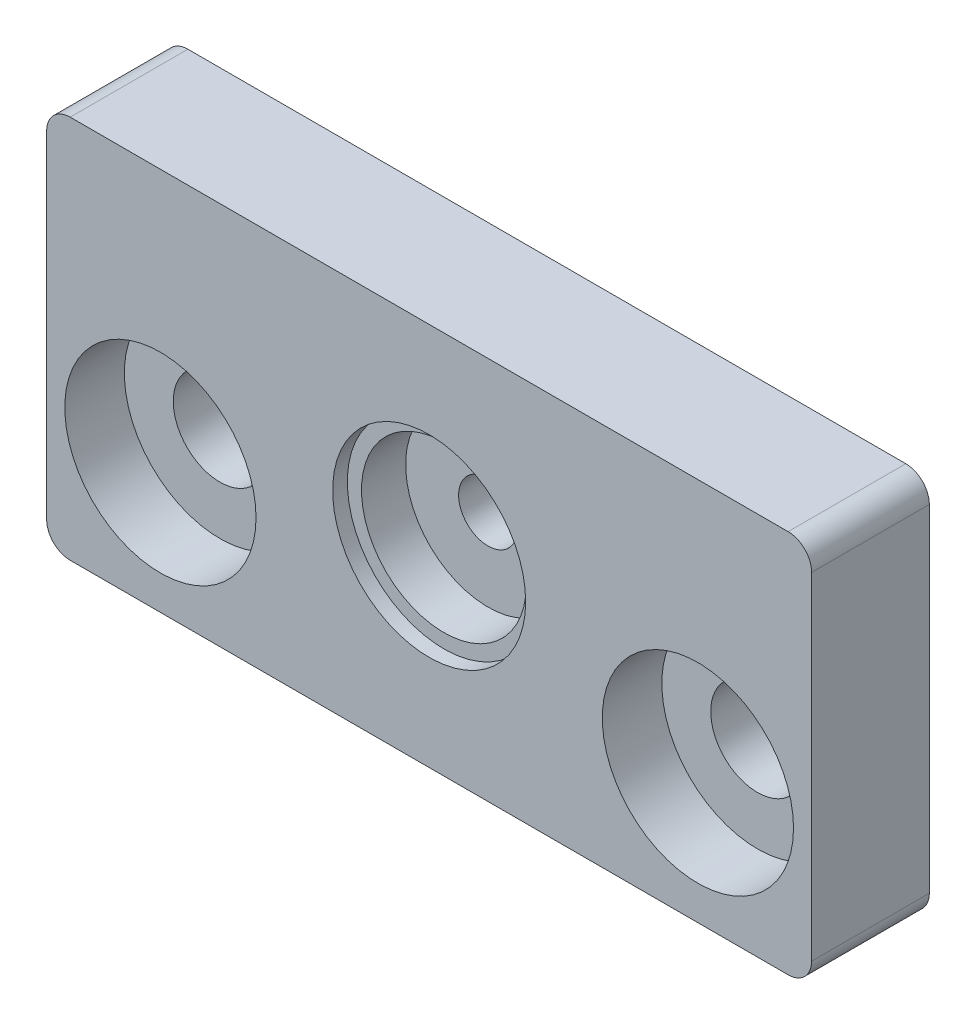
ISO-10303-21;
HEADER;
FILE_DESCRIPTION(('STEP AP214'),'2;1');
FILE_NAME('part.step','',(''),(''),'','','');
FILE_SCHEMA(('AUTOMOTIVE_DESIGN { 1 0 10303 214 1 1 1 1 }'));
ENDSEC;
DATA;
#1=APPLICATION_CONTEXT('core data for automotive mechanical design processes');
#2=APPLICATION_PROTOCOL_DEFINITION('international standard','automotive_design',2000,#1);
#3=PRODUCT_CONTEXT('',#1,'mechanical');
#4=PRODUCT('Part','Part','',(#3));
#5=PRODUCT_RELATED_PRODUCT_CATEGORY('part','',(#4));
#6=PRODUCT_DEFINITION_FORMATION('','',#4);
#7=PRODUCT_DEFINITION_CONTEXT('part definition',#1,'design');
#8=PRODUCT_DEFINITION('design','',#6,#7);
#9=PRODUCT_DEFINITION_SHAPE('','',#8);
#10=(LENGTH_UNIT() NAMED_UNIT(*) SI_UNIT(.MILLI.,.METRE.));
#11=(NAMED_UNIT(*) PLANE_ANGLE_UNIT() SI_UNIT($,.RADIAN.));
#12=(NAMED_UNIT(*) SI_UNIT($,.STERADIAN.) SOLID_ANGLE_UNIT());
#13=UNCERTAINTY_MEASURE_WITH_UNIT(LENGTH_MEASURE(1.E-05),#10,'distance_accuracy_value','');
#14=(GEOMETRIC_REPRESENTATION_CONTEXT(3) GLOBAL_UNCERTAINTY_ASSIGNED_CONTEXT((#13)) GLOBAL_UNIT_ASSIGNED_CONTEXT((#10,
#11,#12)) REPRESENTATION_CONTEXT('',''));
#15=CARTESIAN_POINT('',(0.,0.,0.));
#16=DIRECTION('',(0.,0.,1.));
#17=DIRECTION('',(1.,0.,0.));
#18=AXIS2_PLACEMENT_3D('',#15,#16,#17);
#19=CARTESIAN_POINT('',(0.,0.,6.35));
#20=DIRECTION('',(0.,0.,1.));
#21=DIRECTION('',(1.,0.,0.));
#22=AXIS2_PLACEMENT_3D('',#19,#20,#21);
#23=CYLINDRICAL_SURFACE('',#22,8.89);
#24=CARTESIAN_POINT('',(0.,0.,6.35));
#25=DIRECTION('',(0.,0.,1.));
#26=DIRECTION('',(1.,0.,0.));
#27=AXIS2_PLACEMENT_3D('',#24,#25,#26);
#28=CIRCLE('',#27,8.89);
#29=CARTESIAN_POINT('',(8.89,0.,6.35));
#30=VERTEX_POINT('',#29);
#31=EDGE_CURVE('E145',#30,#30,#28,.T.);
#32=ORIENTED_EDGE('',*,*,#31,.F.);
#33=EDGE_LOOP('',(#32));
#34=FACE_BOUND('',#33,.T.);
#35=CARTESIAN_POINT('',(0.,0.,11.1125));
#36=DIRECTION('',(0.,0.,1.));
#37=DIRECTION('',(1.,0.,0.));
#38=AXIS2_PLACEMENT_3D('',#35,#36,#37);
#39=CIRCLE('',#38,8.89);
#40=CARTESIAN_POINT('',(8.89,0.,11.1125));
#41=VERTEX_POINT('',#40);
#42=EDGE_CURVE('E146',#41,#41,#39,.F.);
#43=ORIENTED_EDGE('',*,*,#42,.F.);
#44=EDGE_LOOP('',(#43));
#45=FACE_BOUND('',#44,.T.);
#46=ADVANCED_FACE('F35',(#34,#45),#23,.F.);
#47=CARTESIAN_POINT('',(0.,0.,0.));
#48=DIRECTION('',(0.,0.,1.));
#49=DIRECTION('',(1.,0.,0.));
#50=AXIS2_PLACEMENT_3D('',#47,#48,#49);
#51=CYLINDRICAL_SURFACE('',#50,3.175);
#52=CARTESIAN_POINT('',(0.,0.,0.));
#53=DIRECTION('',(0.,0.,1.));
#54=DIRECTION('',(1.,0.,0.));
#55=AXIS2_PLACEMENT_3D('',#52,#53,#54);
#56=CIRCLE('',#55,3.175);
#57=CARTESIAN_POINT('',(3.175,0.,0.));
#58=VERTEX_POINT('',#57);
#59=EDGE_CURVE('E128',#58,#58,#56,.T.);
#60=ORIENTED_EDGE('',*,*,#59,.F.);
#61=EDGE_LOOP('',(#60));
#62=FACE_BOUND('',#61,.T.);
#63=CARTESIAN_POINT('',(0.,0.,6.35));
#64=DIRECTION('',(0.,0.,1.));
#65=DIRECTION('',(1.,0.,0.));
#66=AXIS2_PLACEMENT_3D('',#63,#64,#65);
#67=CIRCLE('',#66,3.175);
#68=CARTESIAN_POINT('',(3.175,0.,6.35));
#69=VERTEX_POINT('',#68);
#70=EDGE_CURVE('E134',#69,#69,#67,.F.);
#71=ORIENTED_EDGE('',*,*,#70,.F.);
#72=EDGE_LOOP('',(#71));
#73=FACE_BOUND('',#72,.T.);
#74=ADVANCED_FACE('F244',(#62,#73),#51,.F.);
#75=CARTESIAN_POINT('',(41.275,-20.70735,12.7));
#76=DIRECTION('',(-1.,0.,0.));
#77=DIRECTION('',(0.,0.,1.));
#78=AXIS2_PLACEMENT_3D('',#75,#76,#77);
#79=PLANE('',#78);
#80=DIRECTION('',(0.,1.,0.));
#81=VECTOR('',#80,1.);
#82=CARTESIAN_POINT('',(41.275,-20.70735,12.7));
#83=LINE('',#82,#81);
#84=CARTESIAN_POINT('',(41.275,-18.16735,12.7));
#85=VERTEX_POINT('',#84);
#86=CARTESIAN_POINT('',(41.275,18.16735,12.7));
#87=VERTEX_POINT('',#86);
#88=EDGE_CURVE('E121',#85,#87,#83,.T.);
#89=ORIENTED_EDGE('',*,*,#88,.F.);
#90=DIRECTION('',(0.,0.,-1.));
#91=VECTOR('',#90,1.);
#92=CARTESIAN_POINT('',(41.275,-18.16735,12.7));
#93=LINE('',#92,#91);
#94=CARTESIAN_POINT('',(41.275,-18.16735,0.));
#95=VERTEX_POINT('',#94);
#96=EDGE_CURVE('E105',#85,#95,#93,.T.);
#97=ORIENTED_EDGE('',*,*,#96,.T.);
#98=DIRECTION('',(0.,1.,0.));
#99=VECTOR('',#98,1.);
#100=CARTESIAN_POINT('',(41.275,-20.70735,0.));
#101=LINE('',#100,#99);
#102=CARTESIAN_POINT('',(41.275,18.16735,0.));
#103=VERTEX_POINT('',#102);
#104=EDGE_CURVE('E118',#95,#103,#101,.T.);
#105=ORIENTED_EDGE('',*,*,#104,.T.);
#106=DIRECTION('',(0.,0.,-1.));
#107=VECTOR('',#106,1.);
#108=CARTESIAN_POINT('',(41.275,18.16735,12.7));
#109=LINE('',#108,#107);
#110=EDGE_CURVE('E123',#103,#87,#109,.F.);
#111=ORIENTED_EDGE('',*,*,#110,.T.);
#112=EDGE_LOOP('',(#89,#97,#105,#111));
#113=FACE_BOUND('',#112,.T.);
#114=ADVANCED_FACE('F117',(#113),#79,.F.);
#115=CARTESIAN_POINT('',(-41.275,20.70735,12.7));
#116=DIRECTION('',(0.,-1.,0.));
#117=DIRECTION('',(0.,0.,-1.));
#118=AXIS2_PLACEMENT_3D('',#115,#116,#117);
#119=PLANE('',#118);
#120=DIRECTION('',(-1.,0.,0.));
#121=VECTOR('',#120,1.);
#122=CARTESIAN_POINT('',(-41.275,20.70735,0.));
#123=LINE('',#122,#121);
#124=CARTESIAN_POINT('',(38.735,20.70735,0.));
#125=VERTEX_POINT('',#124);
#126=CARTESIAN_POINT('',(-38.735,20.70735,0.));
#127=VERTEX_POINT('',#126);
#128=EDGE_CURVE('E127',#125,#127,#123,.T.);
#129=ORIENTED_EDGE('',*,*,#128,.T.);
#130=DIRECTION('',(0.,0.,-1.));
#131=VECTOR('',#130,1.);
#132=CARTESIAN_POINT('',(-38.735,20.70735,12.7));
#133=LINE('',#132,#131);
#134=CARTESIAN_POINT('',(-38.735,20.70735,12.7));
#135=VERTEX_POINT('',#134);
#136=EDGE_CURVE('E11',#127,#135,#133,.F.);
#137=ORIENTED_EDGE('',*,*,#136,.T.);
#138=DIRECTION('',(-1.,0.,0.));
#139=VECTOR('',#138,1.);
#140=CARTESIAN_POINT('',(-41.275,20.70735,12.7));
#141=LINE('',#140,#139);
#142=CARTESIAN_POINT('',(38.735,20.70735,12.7));
#143=VERTEX_POINT('',#142);
#144=EDGE_CURVE('E174',#143,#135,#141,.T.);
#145=ORIENTED_EDGE('',*,*,#144,.F.);
#146=DIRECTION('',(0.,0.,-1.));
#147=VECTOR('',#146,1.);
#148=CARTESIAN_POINT('',(38.735,20.70735,12.7));
#149=LINE('',#148,#147);
#150=EDGE_CURVE('E43',#143,#125,#149,.T.);
#151=ORIENTED_EDGE('',*,*,#150,.T.);
#152=EDGE_LOOP('',(#129,#137,#145,#151));
#153=FACE_BOUND('',#152,.T.);
#154=ADVANCED_FACE('F172',(#153),#119,.F.);
#155=CARTESIAN_POINT('',(-41.275,-20.70735,12.7));
#156=DIRECTION('',(1.,0.,0.));
#157=DIRECTION('',(0.,0.,-1.));
#158=AXIS2_PLACEMENT_3D('',#155,#156,#157);
#159=PLANE('',#158);
#160=DIRECTION('',(0.,-1.,0.));
#161=VECTOR('',#160,1.);
#162=CARTESIAN_POINT('',(-41.275,-20.70735,0.));
#163=LINE('',#162,#161);
#164=CARTESIAN_POINT('',(-41.275,18.16735,0.));
#165=VERTEX_POINT('',#164);
#166=CARTESIAN_POINT('',(-41.275,-18.16735,0.));
#167=VERTEX_POINT('',#166);
#168=EDGE_CURVE('E131',#165,#167,#163,.T.);
#169=ORIENTED_EDGE('',*,*,#168,.T.);
#170=DIRECTION('',(0.,0.,-1.));
#171=VECTOR('',#170,1.);
#172=CARTESIAN_POINT('',(-41.275,-18.16735,12.7));
#173=LINE('',#172,#171);
#174=CARTESIAN_POINT('',(-41.275,-18.16735,12.7));
#175=VERTEX_POINT('',#174);
#176=EDGE_CURVE('E50',#167,#175,#173,.F.);
#177=ORIENTED_EDGE('',*,*,#176,.T.);
#178=DIRECTION('',(0.,-1.,0.));
#179=VECTOR('',#178,1.);
#180=CARTESIAN_POINT('',(-41.275,-20.70735,12.7));
#181=LINE('',#180,#179);
#182=CARTESIAN_POINT('',(-41.275,18.16735,12.7));
#183=VERTEX_POINT('',#182);
#184=EDGE_CURVE('E182',#183,#175,#181,.T.);
#185=ORIENTED_EDGE('',*,*,#184,.F.);
#186=DIRECTION('',(0.,0.,-1.));
#187=VECTOR('',#186,1.);
#188=CARTESIAN_POINT('',(-41.275,18.16735,12.7));
#189=LINE('',#188,#187);
#190=EDGE_CURVE('E165',#183,#165,#189,.T.);
#191=ORIENTED_EDGE('',*,*,#190,.T.);
#192=EDGE_LOOP('',(#169,#177,#185,#191));
#193=FACE_BOUND('',#192,.T.);
#194=ADVANCED_FACE('F181',(#193),#159,.F.);
#195=CARTESIAN_POINT('',(-41.275,-20.70735,12.7));
#196=DIRECTION('',(0.,1.,0.));
#197=DIRECTION('',(0.,0.,1.));
#198=AXIS2_PLACEMENT_3D('',#195,#196,#197);
#199=PLANE('',#198);
#200=DIRECTION('',(1.,0.,0.));
#201=VECTOR('',#200,1.);
#202=CARTESIAN_POINT('',(-41.275,-20.70735,0.));
#203=LINE('',#202,#201);
#204=CARTESIAN_POINT('',(-38.735,-20.70735,0.));
#205=VERTEX_POINT('',#204);
#206=CARTESIAN_POINT('',(38.735,-20.70735,0.));
#207=VERTEX_POINT('',#206);
#208=EDGE_CURVE('E141',#205,#207,#203,.T.);
#209=ORIENTED_EDGE('',*,*,#208,.T.);
#210=DIRECTION('',(0.,0.,-1.));
#211=VECTOR('',#210,1.);
#212=CARTESIAN_POINT('',(38.735,-20.70735,12.7));
#213=LINE('',#212,#211);
#214=CARTESIAN_POINT('',(38.735,-20.70735,12.7));
#215=VERTEX_POINT('',#214);
#216=EDGE_CURVE('E106',#207,#215,#213,.F.);
#217=ORIENTED_EDGE('',*,*,#216,.T.);
#218=DIRECTION('',(1.,0.,0.));
#219=VECTOR('',#218,1.);
#220=CARTESIAN_POINT('',(-41.275,-20.70735,12.7));
#221=LINE('',#220,#219);
#222=CARTESIAN_POINT('',(-38.735,-20.70735,12.7));
#223=VERTEX_POINT('',#222);
#224=EDGE_CURVE('E137',#223,#215,#221,.T.);
#225=ORIENTED_EDGE('',*,*,#224,.F.);
#226=DIRECTION('',(0.,0.,-1.));
#227=VECTOR('',#226,1.);
#228=CARTESIAN_POINT('',(-38.735,-20.70735,12.7));
#229=LINE('',#228,#227);
#230=EDGE_CURVE('E111',#223,#205,#229,.T.);
#231=ORIENTED_EDGE('',*,*,#230,.T.);
#232=EDGE_LOOP('',(#209,#217,#225,#231));
#233=FACE_BOUND('',#232,.T.);
#234=ADVANCED_FACE('F225',(#233),#199,.F.);
#235=CARTESIAN_POINT('',(0.,0.,12.7));
#236=DIRECTION('',(0.,0.,-1.));
#237=DIRECTION('',(-1.,0.,0.));
#238=AXIS2_PLACEMENT_3D('',#235,#236,#237);
#239=PLANE('',#238);
#240=CARTESIAN_POINT('',(29.,-6.708000046,12.7));
#241=DIRECTION('',(0.,0.,1.));
#242=DIRECTION('',(1.,0.,0.));
#243=AXIS2_PLACEMENT_3D('',#240,#241,#242);
#244=CIRCLE('',#243,10.31875);
#245=CARTESIAN_POINT('',(39.31875,-6.708000046,12.7));
#246=VERTEX_POINT('',#245);
#247=EDGE_CURVE('E216',#246,#246,#244,.T.);
#248=ORIENTED_EDGE('',*,*,#247,.F.);
#249=EDGE_LOOP('',(#248));
#250=FACE_BOUND('',#249,.T.);
#251=CARTESIAN_POINT('',(-29.,-6.708000046,12.7));
#252=DIRECTION('',(0.,0.,1.));
#253=DIRECTION('',(1.,0.,0.));
#254=AXIS2_PLACEMENT_3D('',#251,#252,#253);
#255=CIRCLE('',#254,10.31875);
#256=CARTESIAN_POINT('',(-18.68125,-6.708000046,12.7));
#257=VERTEX_POINT('',#256);
#258=EDGE_CURVE('E204',#257,#257,#255,.T.);
#259=ORIENTED_EDGE('',*,*,#258,.F.);
#260=EDGE_LOOP('',(#259));
#261=FACE_BOUND('',#260,.T.);
#262=CARTESIAN_POINT('',(0.,0.,12.7));
#263=DIRECTION('',(0.,0.,1.));
#264=DIRECTION('',(1.,0.,0.));
#265=AXIS2_PLACEMENT_3D('',#262,#263,#264);
#266=CIRCLE('',#265,10.414);
#267=CARTESIAN_POINT('',(10.414,0.,12.7));
#268=VERTEX_POINT('',#267);
#269=EDGE_CURVE('E190',#268,#268,#266,.T.);
#270=ORIENTED_EDGE('',*,*,#269,.F.);
#271=EDGE_LOOP('',(#270));
#272=FACE_BOUND('',#271,.T.);
#273=ORIENTED_EDGE('',*,*,#224,.T.);
#274=CARTESIAN_POINT('',(38.735,-18.16735,12.7));
#275=DIRECTION('',(0.,0.,-1.));
#276=DIRECTION('',(-1.,0.,0.));
#277=AXIS2_PLACEMENT_3D('',#274,#275,#276);
#278=CIRCLE('',#277,2.54);
#279=EDGE_CURVE('E163',#215,#85,#278,.F.);
#280=ORIENTED_EDGE('',*,*,#279,.T.);
#281=ORIENTED_EDGE('',*,*,#88,.T.);
#282=CARTESIAN_POINT('',(38.735,18.16735,12.7));
#283=DIRECTION('',(0.,0.,-1.));
#284=DIRECTION('',(-1.,0.,0.));
#285=AXIS2_PLACEMENT_3D('',#282,#283,#284);
#286=CIRCLE('',#285,2.54);
#287=EDGE_CURVE('E158',#87,#143,#286,.F.);
#288=ORIENTED_EDGE('',*,*,#287,.T.);
#289=ORIENTED_EDGE('',*,*,#144,.T.);
#290=CARTESIAN_POINT('',(-38.735,18.16735,12.7));
#291=DIRECTION('',(0.,0.,-1.));
#292=DIRECTION('',(-1.,0.,0.));
#293=AXIS2_PLACEMENT_3D('',#290,#291,#292);
#294=CIRCLE('',#293,2.54);
#295=EDGE_CURVE('E57',#135,#183,#294,.F.);
#296=ORIENTED_EDGE('',*,*,#295,.T.);
#297=ORIENTED_EDGE('',*,*,#184,.T.);
#298=CARTESIAN_POINT('',(-38.735,-18.16735,12.7));
#299=DIRECTION('',(0.,0.,-1.));
#300=DIRECTION('',(-1.,0.,0.));
#301=AXIS2_PLACEMENT_3D('',#298,#299,#300);
#302=CIRCLE('',#301,2.54);
#303=EDGE_CURVE('E161',#175,#223,#302,.F.);
#304=ORIENTED_EDGE('',*,*,#303,.T.);
#305=EDGE_LOOP('',(#273,#280,#281,#288,#289,#296,#297,#304));
#306=FACE_BOUND('',#305,.T.);
#307=ADVANCED_FACE('F222',(#250,#261,#272,#306),#239,.F.);
#308=CARTESIAN_POINT('',(0.,0.,0.));
#309=DIRECTION('',(0.,0.,-1.));
#310=DIRECTION('',(-1.,0.,0.));
#311=AXIS2_PLACEMENT_3D('',#308,#309,#310);
#312=PLANE('',#311);
#313=CARTESIAN_POINT('',(29.,-6.708000046,0.));
#314=DIRECTION('',(0.,0.,1.));
#315=DIRECTION('',(1.,0.,0.));
#316=AXIS2_PLACEMENT_3D('',#313,#314,#315);
#317=CIRCLE('',#316,5.0419);
#318=CARTESIAN_POINT('',(34.0419,-6.708000046,0.));
#319=VERTEX_POINT('',#318);
#320=EDGE_CURVE('E207',#319,#319,#317,.T.);
#321=ORIENTED_EDGE('',*,*,#320,.T.);
#322=EDGE_LOOP('',(#321));
#323=FACE_BOUND('',#322,.T.);
#324=CARTESIAN_POINT('',(-29.,-6.708000046,0.));
#325=DIRECTION('',(0.,0.,1.));
#326=DIRECTION('',(1.,0.,0.));
#327=AXIS2_PLACEMENT_3D('',#324,#325,#326);
#328=CIRCLE('',#327,5.0419);
#329=CARTESIAN_POINT('',(-23.9581,-6.708000046,0.));
#330=VERTEX_POINT('',#329);
#331=EDGE_CURVE('E193',#330,#330,#328,.T.);
#332=ORIENTED_EDGE('',*,*,#331,.T.);
#333=EDGE_LOOP('',(#332));
#334=FACE_BOUND('',#333,.T.);
#335=ORIENTED_EDGE('',*,*,#59,.T.);
#336=EDGE_LOOP('',(#335));
#337=FACE_BOUND('',#336,.T.);
#338=ORIENTED_EDGE('',*,*,#104,.F.);
#339=CARTESIAN_POINT('',(38.735,-18.16735,0.));
#340=DIRECTION('',(0.,0.,-1.));
#341=DIRECTION('',(-1.,0.,0.));
#342=AXIS2_PLACEMENT_3D('',#339,#340,#341);
#343=CIRCLE('',#342,2.54);
#344=EDGE_CURVE('E101',#95,#207,#343,.T.);
#345=ORIENTED_EDGE('',*,*,#344,.T.);
#346=ORIENTED_EDGE('',*,*,#208,.F.);
#347=CARTESIAN_POINT('',(-38.735,-18.16735,0.));
#348=DIRECTION('',(0.,0.,-1.));
#349=DIRECTION('',(-1.,0.,0.));
#350=AXIS2_PLACEMENT_3D('',#347,#348,#349);
#351=CIRCLE('',#350,2.54);
#352=EDGE_CURVE('E112',#205,#167,#351,.T.);
#353=ORIENTED_EDGE('',*,*,#352,.T.);
#354=ORIENTED_EDGE('',*,*,#168,.F.);
#355=CARTESIAN_POINT('',(-38.735,18.16735,0.));
#356=DIRECTION('',(0.,0.,-1.));
#357=DIRECTION('',(-1.,0.,0.));
#358=AXIS2_PLACEMENT_3D('',#355,#356,#357);
#359=CIRCLE('',#358,2.54);
#360=EDGE_CURVE('E152',#165,#127,#359,.T.);
#361=ORIENTED_EDGE('',*,*,#360,.T.);
#362=ORIENTED_EDGE('',*,*,#128,.F.);
#363=CARTESIAN_POINT('',(38.735,18.16735,0.));
#364=DIRECTION('',(0.,0.,-1.));
#365=DIRECTION('',(-1.,0.,0.));
#366=AXIS2_PLACEMENT_3D('',#363,#364,#365);
#367=CIRCLE('',#366,2.54);
#368=EDGE_CURVE('E122',#125,#103,#367,.T.);
#369=ORIENTED_EDGE('',*,*,#368,.T.);
#370=EDGE_LOOP('',(#338,#345,#346,#353,#354,#361,#362,#369));
#371=FACE_BOUND('',#370,.T.);
#372=ADVANCED_FACE('F125',(#323,#334,#337,#371),#312,.T.);
#373=CARTESIAN_POINT('',(0.,0.,6.35));
#374=DIRECTION('',(0.,0.,1.));
#375=DIRECTION('',(1.,0.,0.));
#376=AXIS2_PLACEMENT_3D('',#373,#374,#375);
#377=PLANE('',#376);
#378=ORIENTED_EDGE('',*,*,#31,.T.);
#379=EDGE_LOOP('',(#378));
#380=FACE_BOUND('',#379,.T.);
#381=ORIENTED_EDGE('',*,*,#70,.T.);
#382=EDGE_LOOP('',(#381));
#383=FACE_BOUND('',#382,.T.);
#384=ADVANCED_FACE('F255',(#380,#383),#377,.T.);
#385=CARTESIAN_POINT('',(0.,0.,11.1125));
#386=DIRECTION('',(0.,0.,1.));
#387=DIRECTION('',(1.,0.,0.));
#388=AXIS2_PLACEMENT_3D('',#385,#386,#387);
#389=PLANE('',#388);
#390=CARTESIAN_POINT('',(0.,0.,11.1125));
#391=DIRECTION('',(0.,0.,1.));
#392=DIRECTION('',(1.,0.,0.));
#393=AXIS2_PLACEMENT_3D('',#390,#391,#392);
#394=CIRCLE('',#393,10.414);
#395=CARTESIAN_POINT('',(10.414,0.,11.1125));
#396=VERTEX_POINT('',#395);
#397=EDGE_CURVE('E149',#396,#396,#394,.T.);
#398=ORIENTED_EDGE('',*,*,#397,.T.);
#399=EDGE_LOOP('',(#398));
#400=FACE_BOUND('',#399,.T.);
#401=ORIENTED_EDGE('',*,*,#42,.T.);
#402=EDGE_LOOP('',(#401));
#403=FACE_BOUND('',#402,.T.);
#404=ADVANCED_FACE('F301',(#400,#403),#389,.T.);
#405=CARTESIAN_POINT('',(0.,0.,11.1125));
#406=DIRECTION('',(0.,0.,1.));
#407=DIRECTION('',(1.,0.,0.));
#408=AXIS2_PLACEMENT_3D('',#405,#406,#407);
#409=CYLINDRICAL_SURFACE('',#408,10.414);
#410=ORIENTED_EDGE('',*,*,#397,.F.);
#411=EDGE_LOOP('',(#410));
#412=FACE_BOUND('',#411,.T.);
#413=ORIENTED_EDGE('',*,*,#269,.T.);
#414=EDGE_LOOP('',(#413));
#415=FACE_BOUND('',#414,.T.);
#416=ADVANCED_FACE('F241',(#412,#415),#409,.F.);
#417=CARTESIAN_POINT('',(38.735,-18.16735,12.7));
#418=DIRECTION('',(0.,0.,-1.));
#419=DIRECTION('',(-1.,0.,0.));
#420=AXIS2_PLACEMENT_3D('',#417,#418,#419);
#421=CYLINDRICAL_SURFACE('',#420,2.54);
#422=ORIENTED_EDGE('',*,*,#279,.F.);
#423=ORIENTED_EDGE('',*,*,#216,.F.);
#424=ORIENTED_EDGE('',*,*,#344,.F.);
#425=ORIENTED_EDGE('',*,*,#96,.F.);
#426=EDGE_LOOP('',(#422,#423,#424,#425));
#427=FACE_BOUND('',#426,.T.);
#428=ADVANCED_FACE('F104',(#427),#421,.T.);
#429=CARTESIAN_POINT('',(-38.735,-18.16735,12.7));
#430=DIRECTION('',(0.,0.,-1.));
#431=DIRECTION('',(-1.,0.,0.));
#432=AXIS2_PLACEMENT_3D('',#429,#430,#431);
#433=CYLINDRICAL_SURFACE('',#432,2.54);
#434=ORIENTED_EDGE('',*,*,#303,.F.);
#435=ORIENTED_EDGE('',*,*,#176,.F.);
#436=ORIENTED_EDGE('',*,*,#352,.F.);
#437=ORIENTED_EDGE('',*,*,#230,.F.);
#438=EDGE_LOOP('',(#434,#435,#436,#437));
#439=FACE_BOUND('',#438,.T.);
#440=ADVANCED_FACE('F234',(#439),#433,.T.);
#441=CARTESIAN_POINT('',(-38.735,18.16735,12.7));
#442=DIRECTION('',(0.,0.,-1.));
#443=DIRECTION('',(-1.,0.,0.));
#444=AXIS2_PLACEMENT_3D('',#441,#442,#443);
#445=CYLINDRICAL_SURFACE('',#444,2.54);
#446=ORIENTED_EDGE('',*,*,#295,.F.);
#447=ORIENTED_EDGE('',*,*,#136,.F.);
#448=ORIENTED_EDGE('',*,*,#360,.F.);
#449=ORIENTED_EDGE('',*,*,#190,.F.);
#450=EDGE_LOOP('',(#446,#447,#448,#449));
#451=FACE_BOUND('',#450,.T.);
#452=ADVANCED_FACE('F180',(#451),#445,.T.);
#453=CARTESIAN_POINT('',(38.735,18.16735,12.7));
#454=DIRECTION('',(0.,0.,-1.));
#455=DIRECTION('',(-1.,0.,0.));
#456=AXIS2_PLACEMENT_3D('',#453,#454,#455);
#457=CYLINDRICAL_SURFACE('',#456,2.54);
#458=ORIENTED_EDGE('',*,*,#287,.F.);
#459=ORIENTED_EDGE('',*,*,#110,.F.);
#460=ORIENTED_EDGE('',*,*,#368,.F.);
#461=ORIENTED_EDGE('',*,*,#150,.F.);
#462=EDGE_LOOP('',(#458,#459,#460,#461));
#463=FACE_BOUND('',#462,.T.);
#464=ADVANCED_FACE('F37',(#463),#457,.T.);
#465=CARTESIAN_POINT('',(-29.,-6.708000046,12.7));
#466=DIRECTION('',(0.,0.,1.));
#467=DIRECTION('',(1.,0.,0.));
#468=AXIS2_PLACEMENT_3D('',#465,#466,#467);
#469=CYLINDRICAL_SURFACE('',#468,5.0419);
#470=ORIENTED_EDGE('',*,*,#331,.F.);
#471=EDGE_LOOP('',(#470));
#472=FACE_BOUND('',#471,.T.);
#473=CARTESIAN_POINT('',(-29.,-6.708000046,6.2738));
#474=DIRECTION('',(0.,0.,1.));
#475=DIRECTION('',(1.,0.,0.));
#476=AXIS2_PLACEMENT_3D('',#473,#474,#475);
#477=CIRCLE('',#476,5.0419);
#478=CARTESIAN_POINT('',(-23.9581,-6.708000046,6.2738));
#479=VERTEX_POINT('',#478);
#480=EDGE_CURVE('E198',#479,#479,#477,.T.);
#481=ORIENTED_EDGE('',*,*,#480,.T.);
#482=EDGE_LOOP('',(#481));
#483=FACE_BOUND('',#482,.T.);
#484=ADVANCED_FACE('F336',(#472,#483),#469,.F.);
#485=CARTESIAN_POINT('',(-23.9581,-6.708000046,6.2738));
#486=DIRECTION('',(0.,0.,-1.));
#487=DIRECTION('',(-1.,0.,0.));
#488=AXIS2_PLACEMENT_3D('',#485,#486,#487);
#489=PLANE('',#488);
#490=ORIENTED_EDGE('',*,*,#480,.F.);
#491=EDGE_LOOP('',(#490));
#492=FACE_BOUND('',#491,.T.);
#493=CARTESIAN_POINT('',(-29.,-6.708000046,6.2738));
#494=DIRECTION('',(0.,0.,1.));
#495=DIRECTION('',(1.,0.,0.));
#496=AXIS2_PLACEMENT_3D('',#493,#494,#495);
#497=CIRCLE('',#496,10.31875);
#498=CARTESIAN_POINT('',(-18.68125,-6.708000046,6.2738));
#499=VERTEX_POINT('',#498);
#500=EDGE_CURVE('E201',#499,#499,#497,.T.);
#501=ORIENTED_EDGE('',*,*,#500,.T.);
#502=EDGE_LOOP('',(#501));
#503=FACE_BOUND('',#502,.T.);
#504=ADVANCED_FACE('F341',(#492,#503),#489,.F.);
#505=CARTESIAN_POINT('',(-29.,-6.708000046,12.7));
#506=DIRECTION('',(0.,0.,1.));
#507=DIRECTION('',(1.,0.,0.));
#508=AXIS2_PLACEMENT_3D('',#505,#506,#507);
#509=CYLINDRICAL_SURFACE('',#508,10.31875);
#510=ORIENTED_EDGE('',*,*,#500,.F.);
#511=EDGE_LOOP('',(#510));
#512=FACE_BOUND('',#511,.T.);
#513=ORIENTED_EDGE('',*,*,#258,.T.);
#514=EDGE_LOOP('',(#513));
#515=FACE_BOUND('',#514,.T.);
#516=ADVANCED_FACE('F346',(#512,#515),#509,.F.);
#517=CARTESIAN_POINT('',(29.,-6.708000046,12.7));
#518=DIRECTION('',(0.,0.,1.));
#519=DIRECTION('',(1.,0.,0.));
#520=AXIS2_PLACEMENT_3D('',#517,#518,#519);
#521=CYLINDRICAL_SURFACE('',#520,5.0419);
#522=ORIENTED_EDGE('',*,*,#320,.F.);
#523=EDGE_LOOP('',(#522));
#524=FACE_BOUND('',#523,.T.);
#525=CARTESIAN_POINT('',(29.,-6.708000046,6.2738));
#526=DIRECTION('',(0.,0.,1.));
#527=DIRECTION('',(1.,0.,0.));
#528=AXIS2_PLACEMENT_3D('',#525,#526,#527);
#529=CIRCLE('',#528,5.0419);
#530=CARTESIAN_POINT('',(34.0419,-6.708000046,6.2738));
#531=VERTEX_POINT('',#530);
#532=EDGE_CURVE('E210',#531,#531,#529,.T.);
#533=ORIENTED_EDGE('',*,*,#532,.T.);
#534=EDGE_LOOP('',(#533));
#535=FACE_BOUND('',#534,.T.);
#536=ADVANCED_FACE('F357',(#524,#535),#521,.F.);
#537=CARTESIAN_POINT('',(34.0419,-6.708000046,6.2738));
#538=DIRECTION('',(0.,0.,-1.));
#539=DIRECTION('',(-1.,0.,0.));
#540=AXIS2_PLACEMENT_3D('',#537,#538,#539);
#541=PLANE('',#540);
#542=ORIENTED_EDGE('',*,*,#532,.F.);
#543=EDGE_LOOP('',(#542));
#544=FACE_BOUND('',#543,.T.);
#545=CARTESIAN_POINT('',(29.,-6.708000046,6.2738));
#546=DIRECTION('',(0.,0.,1.));
#547=DIRECTION('',(1.,0.,0.));
#548=AXIS2_PLACEMENT_3D('',#545,#546,#547);
#549=CIRCLE('',#548,10.31875);
#550=CARTESIAN_POINT('',(39.31875,-6.708000046,6.2738));
#551=VERTEX_POINT('',#550);
#552=EDGE_CURVE('E213',#551,#551,#549,.T.);
#553=ORIENTED_EDGE('',*,*,#552,.T.);
#554=EDGE_LOOP('',(#553));
#555=FACE_BOUND('',#554,.T.);
#556=ADVANCED_FACE('F372',(#544,#555),#541,.F.);
#557=CARTESIAN_POINT('',(29.,-6.708000046,12.7));
#558=DIRECTION('',(0.,0.,1.));
#559=DIRECTION('',(1.,0.,0.));
#560=AXIS2_PLACEMENT_3D('',#557,#558,#559);
#561=CYLINDRICAL_SURFACE('',#560,10.31875);
#562=ORIENTED_EDGE('',*,*,#552,.F.);
#563=EDGE_LOOP('',(#562));
#564=FACE_BOUND('',#563,.T.);
#565=ORIENTED_EDGE('',*,*,#247,.T.);
#566=EDGE_LOOP('',(#565));
#567=FACE_BOUND('',#566,.T.);
#568=ADVANCED_FACE('F220',(#564,#567),#561,.F.);
#569=CLOSED_SHELL('',(#46,#74,#114,#154,#194,#234,#307,#372,#384,#404,#416,#428,#440,#452,#464,
#484,#504,#516,#536,#556,#568));
#570=MANIFOLD_SOLID_BREP('B2',#569);
#571=ADVANCED_BREP_SHAPE_REPRESENTATION('',(#18,#570),#14);
#572=SHAPE_DEFINITION_REPRESENTATION(#9,#571);
ENDSEC;
END-ISO-10303-21;
